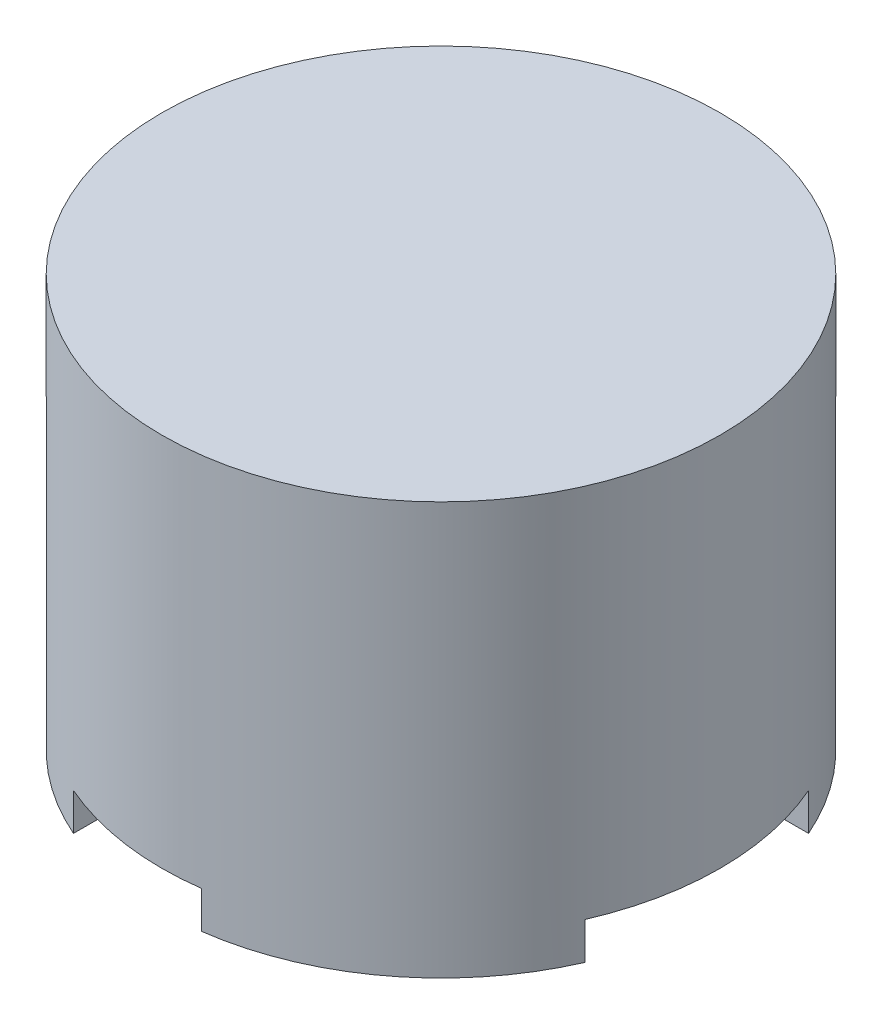
ISO-10303-21;
HEADER;
FILE_DESCRIPTION(('STEP AP214'),'2;1');
FILE_NAME('part.step','',(''),(''),'','','');
FILE_SCHEMA(('AUTOMOTIVE_DESIGN { 1 0 10303 214 1 1 1 1 }'));
ENDSEC;
DATA;
#1=APPLICATION_CONTEXT('core data for automotive mechanical design processes');
#2=APPLICATION_PROTOCOL_DEFINITION('international standard','automotive_design',2000,#1);
#3=PRODUCT_CONTEXT('',#1,'mechanical');
#4=PRODUCT('Part','Part','',(#3));
#5=PRODUCT_RELATED_PRODUCT_CATEGORY('part','',(#4));
#6=PRODUCT_DEFINITION_FORMATION('','',#4);
#7=PRODUCT_DEFINITION_CONTEXT('part definition',#1,'design');
#8=PRODUCT_DEFINITION('design','',#6,#7);
#9=PRODUCT_DEFINITION_SHAPE('','',#8);
#10=(LENGTH_UNIT() NAMED_UNIT(*) SI_UNIT(.MILLI.,.METRE.));
#11=(NAMED_UNIT(*) PLANE_ANGLE_UNIT() SI_UNIT($,.RADIAN.));
#12=(NAMED_UNIT(*) SI_UNIT($,.STERADIAN.) SOLID_ANGLE_UNIT());
#13=UNCERTAINTY_MEASURE_WITH_UNIT(LENGTH_MEASURE(1.E-05),#10,'distance_accuracy_value','');
#14=(GEOMETRIC_REPRESENTATION_CONTEXT(3) GLOBAL_UNCERTAINTY_ASSIGNED_CONTEXT((#13)) GLOBAL_UNIT_ASSIGNED_CONTEXT((#10,
#11,#12)) REPRESENTATION_CONTEXT('',''));
#15=CARTESIAN_POINT('',(0.,0.,0.));
#16=DIRECTION('',(0.,0.,1.));
#17=DIRECTION('',(1.,0.,0.));
#18=AXIS2_PLACEMENT_3D('',#15,#16,#17);
#19=CARTESIAN_POINT('',(-9.525,-19.7231,28.3950139545334));
#20=DIRECTION('',(1.,0.,0.));
#21=DIRECTION('',(0.,1.,0.));
#22=AXIS2_PLACEMENT_3D('',#19,#20,#21);
#23=PLANE('',#22);
#24=DIRECTION('',(0.,0.,1.));
#25=VECTOR('',#24,1.);
#26=CARTESIAN_POINT('',(-9.525,-22.8981,28.3950139545334));
#27=LINE('',#26,#25);
#28=CARTESIAN_POINT('',(-9.525,-22.8981,18.3079431190399));
#29=VERTEX_POINT('',#28);
#30=CARTESIAN_POINT('',(-9.525,-22.8981,21.8245167472272));
#31=VERTEX_POINT('',#30);
#32=EDGE_CURVE('E226',#29,#31,#27,.T.);
#33=ORIENTED_EDGE('',*,*,#32,.F.);
#34=DIRECTION('',(0.,1.,0.));
#35=VECTOR('',#34,1.);
#36=CARTESIAN_POINT('',(-9.525,0.,18.3079431190399));
#37=LINE('',#36,#35);
#38=CARTESIAN_POINT('',(-9.525,-19.7231,18.3079431190399));
#39=VERTEX_POINT('',#38);
#40=EDGE_CURVE('E53',#29,#39,#37,.T.);
#41=ORIENTED_EDGE('',*,*,#40,.T.);
#42=DIRECTION('',(0.,0.,1.));
#43=VECTOR('',#42,1.);
#44=CARTESIAN_POINT('',(-9.525,-19.7231,28.3950139545334));
#45=LINE('',#44,#43);
#46=CARTESIAN_POINT('',(-9.525,-19.7231,21.8245167472272));
#47=VERTEX_POINT('',#46);
#48=EDGE_CURVE('E215',#39,#47,#45,.T.);
#49=ORIENTED_EDGE('',*,*,#48,.T.);
#50=DIRECTION('',(0.,1.,0.));
#51=VECTOR('',#50,1.);
#52=CARTESIAN_POINT('',(-9.52500000000001,12.2809,21.8245167472272));
#53=LINE('',#52,#51);
#54=EDGE_CURVE('E258',#31,#47,#53,.T.);
#55=ORIENTED_EDGE('',*,*,#54,.F.);
#56=EDGE_LOOP('',(#33,#41,#49,#55));
#57=FACE_BOUND('',#56,.T.);
#58=ADVANCED_FACE('F38',(#57),#23,.T.);
#59=CARTESIAN_POINT('',(-28.3950139545334,-19.7231,9.525));
#60=DIRECTION('',(0.,0.,-1.));
#61=DIRECTION('',(-1.,0.,0.));
#62=AXIS2_PLACEMENT_3D('',#59,#60,#61);
#63=PLANE('',#62);
#64=DIRECTION('',(1.,0.,0.));
#65=VECTOR('',#64,1.);
#66=CARTESIAN_POINT('',(-28.3950139545334,-19.7231,9.525));
#67=LINE('',#66,#65);
#68=CARTESIAN_POINT('',(-21.8245167472272,-19.7231,9.525));
#69=VERTEX_POINT('',#68);
#70=CARTESIAN_POINT('',(-18.3079431190399,-19.7231,9.525));
#71=VERTEX_POINT('',#70);
#72=EDGE_CURVE('E234',#69,#71,#67,.T.);
#73=ORIENTED_EDGE('',*,*,#72,.T.);
#74=DIRECTION('',(0.,1.,0.));
#75=VECTOR('',#74,1.);
#76=CARTESIAN_POINT('',(-18.3079431190399,0.,9.525));
#77=LINE('',#76,#75);
#78=CARTESIAN_POINT('',(-18.3079431190399,-22.8981,9.525));
#79=VERTEX_POINT('',#78);
#80=EDGE_CURVE('E206',#71,#79,#77,.F.);
#81=ORIENTED_EDGE('',*,*,#80,.T.);
#82=DIRECTION('',(1.,0.,0.));
#83=VECTOR('',#82,1.);
#84=CARTESIAN_POINT('',(-23.8125,-22.8981,9.525));
#85=LINE('',#84,#83);
#86=CARTESIAN_POINT('',(-21.8245167472272,-22.8981,9.525));
#87=VERTEX_POINT('',#86);
#88=EDGE_CURVE('E357',#87,#79,#85,.T.);
#89=ORIENTED_EDGE('',*,*,#88,.F.);
#90=DIRECTION('',(0.,1.,0.));
#91=VECTOR('',#90,1.);
#92=CARTESIAN_POINT('',(-21.8245167472272,12.2809,9.525));
#93=LINE('',#92,#91);
#94=EDGE_CURVE('E255',#69,#87,#93,.F.);
#95=ORIENTED_EDGE('',*,*,#94,.F.);
#96=EDGE_LOOP('',(#73,#81,#89,#95));
#97=FACE_BOUND('',#96,.T.);
#98=ADVANCED_FACE('F417',(#97),#63,.T.);
#99=CARTESIAN_POINT('',(3.175,-19.7231,28.3950139545334));
#100=DIRECTION('',(-1.,0.,0.));
#101=DIRECTION('',(0.,0.,1.));
#102=AXIS2_PLACEMENT_3D('',#99,#100,#101);
#103=PLANE('',#102);
#104=DIRECTION('',(0.,0.,-1.));
#105=VECTOR('',#104,1.);
#106=CARTESIAN_POINT('',(3.175,-19.7231,28.3950139545334));
#107=LINE('',#106,#105);
#108=CARTESIAN_POINT('',(3.175,-19.7231,23.5998841363681));
#109=VERTEX_POINT('',#108);
#110=CARTESIAN_POINT('',(3.17499999999999,-19.7231,20.3918067186309));
#111=VERTEX_POINT('',#110);
#112=EDGE_CURVE('E212',#109,#111,#107,.T.);
#113=ORIENTED_EDGE('',*,*,#112,.T.);
#114=DIRECTION('',(0.,1.,0.));
#115=VECTOR('',#114,1.);
#116=CARTESIAN_POINT('',(3.17499999999999,0.,20.3918067186309));
#117=LINE('',#116,#115);
#118=CARTESIAN_POINT('',(3.175,-22.8981,20.3918067186309));
#119=VERTEX_POINT('',#118);
#120=EDGE_CURVE('E196',#111,#119,#117,.F.);
#121=ORIENTED_EDGE('',*,*,#120,.T.);
#122=DIRECTION('',(0.,0.,-1.));
#123=VECTOR('',#122,1.);
#124=CARTESIAN_POINT('',(3.175,-22.8981,0.));
#125=LINE('',#124,#123);
#126=CARTESIAN_POINT('',(3.175,-22.8981,23.5998841363681));
#127=VERTEX_POINT('',#126);
#128=EDGE_CURVE('E355',#127,#119,#125,.T.);
#129=ORIENTED_EDGE('',*,*,#128,.F.);
#130=DIRECTION('',(0.,1.,0.));
#131=VECTOR('',#130,1.);
#132=CARTESIAN_POINT('',(3.17499999999999,12.2809,23.5998841363681));
#133=LINE('',#132,#131);
#134=EDGE_CURVE('E221',#109,#127,#133,.F.);
#135=ORIENTED_EDGE('',*,*,#134,.F.);
#136=EDGE_LOOP('',(#113,#121,#129,#135));
#137=FACE_BOUND('',#136,.T.);
#138=ADVANCED_FACE('F219',(#137),#103,.T.);
#139=CARTESIAN_POINT('',(3.175,-19.7231,9.525));
#140=DIRECTION('',(0.,0.,-1.));
#141=DIRECTION('',(-1.,0.,0.));
#142=AXIS2_PLACEMENT_3D('',#139,#140,#141);
#143=PLANE('',#142);
#144=DIRECTION('',(1.,0.,0.));
#145=VECTOR('',#144,1.);
#146=CARTESIAN_POINT('',(3.175,-22.8981,9.525));
#147=LINE('',#146,#145);
#148=CARTESIAN_POINT('',(18.3079431190399,-22.8981,9.525));
#149=VERTEX_POINT('',#148);
#150=CARTESIAN_POINT('',(21.8245167472272,-22.8981,9.525));
#151=VERTEX_POINT('',#150);
#152=EDGE_CURVE('E223',#149,#151,#147,.T.);
#153=ORIENTED_EDGE('',*,*,#152,.F.);
#154=DIRECTION('',(0.,1.,0.));
#155=VECTOR('',#154,1.);
#156=CARTESIAN_POINT('',(18.3079431190399,0.,9.525));
#157=LINE('',#156,#155);
#158=CARTESIAN_POINT('',(18.3079431190399,-19.7231,9.525));
#159=VERTEX_POINT('',#158);
#160=EDGE_CURVE('E60',#149,#159,#157,.T.);
#161=ORIENTED_EDGE('',*,*,#160,.T.);
#162=DIRECTION('',(1.,0.,0.));
#163=VECTOR('',#162,1.);
#164=CARTESIAN_POINT('',(3.175,-19.7231,9.525));
#165=LINE('',#164,#163);
#166=CARTESIAN_POINT('',(21.8245167472272,-19.7231,9.525));
#167=VERTEX_POINT('',#166);
#168=EDGE_CURVE('E222',#159,#167,#165,.T.);
#169=ORIENTED_EDGE('',*,*,#168,.T.);
#170=DIRECTION('',(0.,1.,0.));
#171=VECTOR('',#170,1.);
#172=CARTESIAN_POINT('',(21.8245167472272,12.2809,9.525));
#173=LINE('',#172,#171);
#174=EDGE_CURVE('E251',#151,#167,#173,.T.);
#175=ORIENTED_EDGE('',*,*,#174,.F.);
#176=EDGE_LOOP('',(#153,#161,#169,#175));
#177=FACE_BOUND('',#176,.T.);
#178=ADVANCED_FACE('F563',(#177),#143,.T.);
#179=CARTESIAN_POINT('',(-28.3950139545334,-19.7231,-3.175));
#180=DIRECTION('',(0.,0.,1.));
#181=DIRECTION('',(1.,0.,0.));
#182=AXIS2_PLACEMENT_3D('',#179,#180,#181);
#183=PLANE('',#182);
#184=DIRECTION('',(-1.,0.,0.));
#185=VECTOR('',#184,1.);
#186=CARTESIAN_POINT('',(-28.3950139545334,-22.8981,-3.175));
#187=LINE('',#186,#185);
#188=CARTESIAN_POINT('',(-20.3918067186309,-22.8981,-3.175));
#189=VERTEX_POINT('',#188);
#190=CARTESIAN_POINT('',(-23.5998841363681,-22.8981,-3.175));
#191=VERTEX_POINT('',#190);
#192=EDGE_CURVE('E231',#189,#191,#187,.T.);
#193=ORIENTED_EDGE('',*,*,#192,.F.);
#194=DIRECTION('',(0.,1.,0.));
#195=VECTOR('',#194,1.);
#196=CARTESIAN_POINT('',(-20.3918067186309,0.,-3.175));
#197=LINE('',#196,#195);
#198=CARTESIAN_POINT('',(-20.3918067186309,-19.7231,-3.175));
#199=VERTEX_POINT('',#198);
#200=EDGE_CURVE('E380',#189,#199,#197,.T.);
#201=ORIENTED_EDGE('',*,*,#200,.T.);
#202=DIRECTION('',(-1.,0.,0.));
#203=VECTOR('',#202,1.);
#204=CARTESIAN_POINT('',(-28.3950139545334,-19.7231,-3.175));
#205=LINE('',#204,#203);
#206=CARTESIAN_POINT('',(-23.5998841363681,-19.7231,-3.175));
#207=VERTEX_POINT('',#206);
#208=EDGE_CURVE('E228',#199,#207,#205,.T.);
#209=ORIENTED_EDGE('',*,*,#208,.T.);
#210=DIRECTION('',(0.,1.,0.));
#211=VECTOR('',#210,1.);
#212=CARTESIAN_POINT('',(-23.5998841363681,12.2809,-3.175));
#213=LINE('',#212,#211);
#214=EDGE_CURVE('E248',#191,#207,#213,.T.);
#215=ORIENTED_EDGE('',*,*,#214,.F.);
#216=EDGE_LOOP('',(#193,#201,#209,#215));
#217=FACE_BOUND('',#216,.T.);
#218=ADVANCED_FACE('F379',(#217),#183,.T.);
#219=CARTESIAN_POINT('',(-9.525,-19.7231,-3.175));
#220=DIRECTION('',(1.,0.,0.));
#221=DIRECTION('',(0.,0.,-1.));
#222=AXIS2_PLACEMENT_3D('',#219,#220,#221);
#223=PLANE('',#222);
#224=DIRECTION('',(0.,0.,1.));
#225=VECTOR('',#224,1.);
#226=CARTESIAN_POINT('',(-9.525,-19.7231,-3.175));
#227=LINE('',#226,#225);
#228=CARTESIAN_POINT('',(-9.525,-19.7231,-21.8245167472272));
#229=VERTEX_POINT('',#228);
#230=CARTESIAN_POINT('',(-9.525,-19.7231,-18.3079431190399));
#231=VERTEX_POINT('',#230);
#232=EDGE_CURVE('E381',#229,#231,#227,.T.);
#233=ORIENTED_EDGE('',*,*,#232,.T.);
#234=DIRECTION('',(0.,1.,0.));
#235=VECTOR('',#234,1.);
#236=CARTESIAN_POINT('',(-9.525,0.,-18.3079431190399));
#237=LINE('',#236,#235);
#238=CARTESIAN_POINT('',(-9.525,-22.8981,-18.3079431190399));
#239=VERTEX_POINT('',#238);
#240=EDGE_CURVE('E398',#231,#239,#237,.F.);
#241=ORIENTED_EDGE('',*,*,#240,.T.);
#242=DIRECTION('',(0.,0.,1.));
#243=VECTOR('',#242,1.);
#244=CARTESIAN_POINT('',(-9.525,-22.8981,0.));
#245=LINE('',#244,#243);
#246=CARTESIAN_POINT('',(-9.525,-22.8981,-21.8245167472272));
#247=VERTEX_POINT('',#246);
#248=EDGE_CURVE('E352',#247,#239,#245,.T.);
#249=ORIENTED_EDGE('',*,*,#248,.F.);
#250=DIRECTION('',(0.,1.,0.));
#251=VECTOR('',#250,1.);
#252=CARTESIAN_POINT('',(-9.525,12.2809,-21.8245167472272));
#253=LINE('',#252,#251);
#254=EDGE_CURVE('E245',#229,#247,#253,.F.);
#255=ORIENTED_EDGE('',*,*,#254,.F.);
#256=EDGE_LOOP('',(#233,#241,#249,#255));
#257=FACE_BOUND('',#256,.T.);
#258=ADVANCED_FACE('F579',(#257),#223,.T.);
#259=CARTESIAN_POINT('',(9.525,-19.7231,-9.525));
#260=DIRECTION('',(-1.,0.,0.));
#261=DIRECTION('',(0.,-1.,0.));
#262=AXIS2_PLACEMENT_3D('',#259,#260,#261);
#263=PLANE('',#262);
#264=DIRECTION('',(0.,0.,-1.));
#265=VECTOR('',#264,1.);
#266=CARTESIAN_POINT('',(9.525,-22.8981,-9.525));
#267=LINE('',#266,#265);
#268=CARTESIAN_POINT('',(9.525,-22.8981,-18.3079431190399));
#269=VERTEX_POINT('',#268);
#270=CARTESIAN_POINT('',(9.525,-22.8981,-21.8245167472272));
#271=VERTEX_POINT('',#270);
#272=EDGE_CURVE('E385',#269,#271,#267,.T.);
#273=ORIENTED_EDGE('',*,*,#272,.F.);
#274=DIRECTION('',(0.,1.,0.));
#275=VECTOR('',#274,1.);
#276=CARTESIAN_POINT('',(9.525,0.,-18.3079431190399));
#277=LINE('',#276,#275);
#278=CARTESIAN_POINT('',(9.525,-19.7231,-18.3079431190399));
#279=VERTEX_POINT('',#278);
#280=EDGE_CURVE('E401',#269,#279,#277,.T.);
#281=ORIENTED_EDGE('',*,*,#280,.T.);
#282=DIRECTION('',(0.,0.,-1.));
#283=VECTOR('',#282,1.);
#284=CARTESIAN_POINT('',(9.525,-19.7231,-9.525));
#285=LINE('',#284,#283);
#286=CARTESIAN_POINT('',(9.525,-19.7231,-21.8245167472272));
#287=VERTEX_POINT('',#286);
#288=EDGE_CURVE('E387',#279,#287,#285,.T.);
#289=ORIENTED_EDGE('',*,*,#288,.T.);
#290=DIRECTION('',(0.,1.,0.));
#291=VECTOR('',#290,1.);
#292=CARTESIAN_POINT('',(9.525,12.2809,-21.8245167472272));
#293=LINE('',#292,#291);
#294=EDGE_CURVE('E242',#271,#287,#293,.T.);
#295=ORIENTED_EDGE('',*,*,#294,.F.);
#296=EDGE_LOOP('',(#273,#281,#289,#295));
#297=FACE_BOUND('',#296,.T.);
#298=ADVANCED_FACE('F588',(#297),#263,.T.);
#299=CARTESIAN_POINT('',(9.525,-19.7231,-9.525));
#300=DIRECTION('',(0.,0.,1.));
#301=DIRECTION('',(1.,0.,0.));
#302=AXIS2_PLACEMENT_3D('',#299,#300,#301);
#303=PLANE('',#302);
#304=DIRECTION('',(-1.,0.,0.));
#305=VECTOR('',#304,1.);
#306=CARTESIAN_POINT('',(9.525,-19.7231,-9.525));
#307=LINE('',#306,#305);
#308=CARTESIAN_POINT('',(21.8245167472272,-19.7231,-9.525));
#309=VERTEX_POINT('',#308);
#310=CARTESIAN_POINT('',(18.3079431190399,-19.7231,-9.525));
#311=VERTEX_POINT('',#310);
#312=EDGE_CURVE('E388',#309,#311,#307,.T.);
#313=ORIENTED_EDGE('',*,*,#312,.T.);
#314=DIRECTION('',(0.,1.,0.));
#315=VECTOR('',#314,1.);
#316=CARTESIAN_POINT('',(18.3079431190399,0.,-9.525));
#317=LINE('',#316,#315);
#318=CARTESIAN_POINT('',(18.3079431190399,-22.8981,-9.525));
#319=VERTEX_POINT('',#318);
#320=EDGE_CURVE('E403',#311,#319,#317,.F.);
#321=ORIENTED_EDGE('',*,*,#320,.T.);
#322=DIRECTION('',(-1.,0.,0.));
#323=VECTOR('',#322,1.);
#324=CARTESIAN_POINT('',(-23.8125,-22.8981,-9.525));
#325=LINE('',#324,#323);
#326=CARTESIAN_POINT('',(21.8245167472272,-22.8981,-9.525));
#327=VERTEX_POINT('',#326);
#328=EDGE_CURVE('E274',#327,#319,#325,.T.);
#329=ORIENTED_EDGE('',*,*,#328,.F.);
#330=DIRECTION('',(0.,1.,0.));
#331=VECTOR('',#330,1.);
#332=CARTESIAN_POINT('',(21.8245167472272,12.2809,-9.525));
#333=LINE('',#332,#331);
#334=EDGE_CURVE('E238',#309,#327,#333,.F.);
#335=ORIENTED_EDGE('',*,*,#334,.F.);
#336=EDGE_LOOP('',(#313,#321,#329,#335));
#337=FACE_BOUND('',#336,.T.);
#338=ADVANCED_FACE('F447',(#337),#303,.T.);
#339=CARTESIAN_POINT('',(0.,0.,0.));
#340=DIRECTION('',(0.173648177666931,0.,-0.984807753012208));
#341=DIRECTION('',(-0.984807753012208,0.,-0.173648177666931));
#342=AXIS2_PLACEMENT_3D('',#339,#340,#341);
#343=PLANE('',#342);
#344=DIRECTION('',(0.,-1.,0.));
#345=VECTOR('',#344,1.);
#346=CARTESIAN_POINT('',(20.3239700704098,3.7592,3.58366427852457));
#347=LINE('',#346,#345);
#348=CARTESIAN_POINT('',(20.3239700704098,3.7592,3.58366427852457));
#349=VERTEX_POINT('',#348);
#350=CARTESIAN_POINT('',(20.3239700704098,-3.7592,3.58366427852457));
#351=VERTEX_POINT('',#350);
#352=EDGE_CURVE('E271',#349,#351,#347,.T.);
#353=ORIENTED_EDGE('',*,*,#352,.T.);
#354=DIRECTION('',(-0.984807753012208,0.,-0.173648177666931));
#355=VECTOR('',#354,1.);
#356=CARTESIAN_POINT('',(20.3239700704098,-3.7592,3.58366427852457));
#357=LINE('',#356,#355);
#358=CARTESIAN_POINT('',(17.5098818485571,-3.7592,3.08746459891803));
#359=VERTEX_POINT('',#358);
#360=EDGE_CURVE('E275',#351,#359,#357,.T.);
#361=ORIENTED_EDGE('',*,*,#360,.T.);
#362=DIRECTION('',(0.,1.,0.));
#363=VECTOR('',#362,1.);
#364=CARTESIAN_POINT('',(17.5098818485571,3.7592,3.08746459891803));
#365=LINE('',#364,#363);
#366=CARTESIAN_POINT('',(17.5098818485571,3.7592,3.08746459891803));
#367=VERTEX_POINT('',#366);
#368=EDGE_CURVE('E277',#359,#367,#365,.T.);
#369=ORIENTED_EDGE('',*,*,#368,.T.);
#370=DIRECTION('',(0.984807753012208,0.,0.173648177666931));
#371=VECTOR('',#370,1.);
#372=CARTESIAN_POINT('',(20.3239700704098,3.7592,3.58366427852457));
#373=LINE('',#372,#371);
#374=EDGE_CURVE('E280',#367,#349,#373,.T.);
#375=ORIENTED_EDGE('',*,*,#374,.T.);
#376=EDGE_LOOP('',(#353,#361,#369,#375));
#377=FACE_BOUND('',#376,.T.);
#378=ADVANCED_FACE('F443',(#377),#343,.T.);
#379=CARTESIAN_POINT('',(0.,0.,0.));
#380=DIRECTION('',(-0.173648177666931,0.,-0.984807753012208));
#381=DIRECTION('',(-0.984807753012208,0.,0.173648177666931));
#382=AXIS2_PLACEMENT_3D('',#379,#380,#381);
#383=PLANE('',#382);
#384=DIRECTION('',(0.,-1.,0.));
#385=VECTOR('',#384,1.);
#386=CARTESIAN_POINT('',(20.3239700704098,3.7592,-3.58366427852457));
#387=LINE('',#386,#385);
#388=CARTESIAN_POINT('',(20.3239700704098,3.7592,-3.58366427852457));
#389=VERTEX_POINT('',#388);
#390=CARTESIAN_POINT('',(20.3239700704098,-3.7592,-3.58366427852457));
#391=VERTEX_POINT('',#390);
#392=EDGE_CURVE('E282',#389,#391,#387,.T.);
#393=ORIENTED_EDGE('',*,*,#392,.F.);
#394=DIRECTION('',(0.984807753012208,0.,-0.173648177666931));
#395=VECTOR('',#394,1.);
#396=CARTESIAN_POINT('',(20.3239700704098,3.7592,-3.58366427852457));
#397=LINE('',#396,#395);
#398=CARTESIAN_POINT('',(17.5098818485571,3.75919999999999,-3.08746459891803));
#399=VERTEX_POINT('',#398);
#400=EDGE_CURVE('E290',#399,#389,#397,.T.);
#401=ORIENTED_EDGE('',*,*,#400,.F.);
#402=DIRECTION('',(0.,1.,0.));
#403=VECTOR('',#402,1.);
#404=CARTESIAN_POINT('',(17.5098818485571,3.7592,-3.08746459891803));
#405=LINE('',#404,#403);
#406=CARTESIAN_POINT('',(17.5098818485571,-3.7592,-3.08746459891803));
#407=VERTEX_POINT('',#406);
#408=EDGE_CURVE('E287',#407,#399,#405,.T.);
#409=ORIENTED_EDGE('',*,*,#408,.F.);
#410=DIRECTION('',(-0.984807753012208,0.,0.173648177666931));
#411=VECTOR('',#410,1.);
#412=CARTESIAN_POINT('',(20.3239700704098,-3.7592,-3.58366427852457));
#413=LINE('',#412,#411);
#414=EDGE_CURVE('E285',#391,#407,#413,.T.);
#415=ORIENTED_EDGE('',*,*,#414,.F.);
#416=EDGE_LOOP('',(#393,#401,#409,#415));
#417=FACE_BOUND('',#416,.T.);
#418=ADVANCED_FACE('F446',(#417),#383,.F.);
#419=CARTESIAN_POINT('',(20.3239700704098,3.7592,-3.58366427852457));
#420=DIRECTION('',(0.,-1.,0.));
#421=DIRECTION('',(0.,0.,1.));
#422=AXIS2_PLACEMENT_3D('',#419,#420,#421);
#423=PLANE('',#422);
#424=ORIENTED_EDGE('',*,*,#400,.T.);
#425=CARTESIAN_POINT('',(0.,3.7592,0.));
#426=DIRECTION('',(0.,-1.,0.));
#427=DIRECTION('',(0.,0.,1.));
#428=AXIS2_PLACEMENT_3D('',#425,#426,#427);
#429=CIRCLE('',#428,20.6375000686635);
#430=EDGE_CURVE('E292',#389,#349,#429,.T.);
#431=ORIENTED_EDGE('',*,*,#430,.T.);
#432=ORIENTED_EDGE('',*,*,#374,.F.);
#433=CARTESIAN_POINT('',(0.,3.7592,0.));
#434=DIRECTION('',(0.,-1.,0.));
#435=DIRECTION('',(0.,0.,1.));
#436=AXIS2_PLACEMENT_3D('',#433,#434,#435);
#437=CIRCLE('',#436,17.78);
#438=EDGE_CURVE('E295',#399,#367,#437,.T.);
#439=ORIENTED_EDGE('',*,*,#438,.F.);
#440=EDGE_LOOP('',(#424,#431,#432,#439));
#441=FACE_BOUND('',#440,.T.);
#442=ADVANCED_FACE('F451',(#441),#423,.T.);
#443=CARTESIAN_POINT('',(20.3239700704098,-3.7592,-3.58366427852457));
#444=DIRECTION('',(0.,1.,0.));
#445=DIRECTION('',(0.,0.,-1.));
#446=AXIS2_PLACEMENT_3D('',#443,#444,#445);
#447=PLANE('',#446);
#448=CARTESIAN_POINT('',(0.,-3.7592,0.));
#449=DIRECTION('',(0.,-1.,0.));
#450=DIRECTION('',(0.,0.,1.));
#451=AXIS2_PLACEMENT_3D('',#448,#449,#450);
#452=CIRCLE('',#451,17.78);
#453=EDGE_CURVE('E298',#407,#359,#452,.T.);
#454=ORIENTED_EDGE('',*,*,#453,.T.);
#455=ORIENTED_EDGE('',*,*,#360,.F.);
#456=CARTESIAN_POINT('',(0.,-3.7592,0.));
#457=DIRECTION('',(0.,-1.,0.));
#458=DIRECTION('',(0.,0.,1.));
#459=AXIS2_PLACEMENT_3D('',#456,#457,#458);
#460=CIRCLE('',#459,20.6375000686635);
#461=EDGE_CURVE('E301',#391,#351,#460,.T.);
#462=ORIENTED_EDGE('',*,*,#461,.F.);
#463=ORIENTED_EDGE('',*,*,#414,.T.);
#464=EDGE_LOOP('',(#454,#455,#462,#463));
#465=FACE_BOUND('',#464,.T.);
#466=ADVANCED_FACE('F457',(#465),#447,.T.);
#467=CARTESIAN_POINT('',(0.,0.,0.));
#468=DIRECTION('',(0.,-1.,0.));
#469=DIRECTION('',(0.,0.,1.));
#470=AXIS2_PLACEMENT_3D('',#467,#468,#469);
#471=CYLINDRICAL_SURFACE('',#470,20.6375000686635);
#472=ORIENTED_EDGE('',*,*,#461,.T.);
#473=ORIENTED_EDGE('',*,*,#352,.F.);
#474=ORIENTED_EDGE('',*,*,#430,.F.);
#475=ORIENTED_EDGE('',*,*,#392,.T.);
#476=EDGE_LOOP('',(#472,#473,#474,#475));
#477=FACE_BOUND('',#476,.T.);
#478=ADVANCED_FACE('F453',(#477),#471,.F.);
#479=CARTESIAN_POINT('',(0.,0.,0.));
#480=DIRECTION('',(-0.173648177666931,0.,0.984807753012208));
#481=DIRECTION('',(0.984807753012208,0.,0.173648177666931));
#482=AXIS2_PLACEMENT_3D('',#479,#480,#481);
#483=PLANE('',#482);
#484=DIRECTION('',(0.,-1.,0.));
#485=VECTOR('',#484,1.);
#486=CARTESIAN_POINT('',(-20.3239700704098,3.7592,-3.58366427852457));
#487=LINE('',#486,#485);
#488=CARTESIAN_POINT('',(-20.3239700704098,3.7592,-3.58366427852457));
#489=VERTEX_POINT('',#488);
#490=CARTESIAN_POINT('',(-20.3239700704098,-3.7592,-3.58366427852457));
#491=VERTEX_POINT('',#490);
#492=EDGE_CURVE('E304',#489,#491,#487,.T.);
#493=ORIENTED_EDGE('',*,*,#492,.T.);
#494=DIRECTION('',(0.984807753012208,0.,0.173648177666931));
#495=VECTOR('',#494,1.);
#496=CARTESIAN_POINT('',(-20.3239700704098,-3.7592,-3.58366427852457));
#497=LINE('',#496,#495);
#498=CARTESIAN_POINT('',(-17.5098818485571,-3.7592,-3.08746459891803));
#499=VERTEX_POINT('',#498);
#500=EDGE_CURVE('E307',#491,#499,#497,.T.);
#501=ORIENTED_EDGE('',*,*,#500,.T.);
#502=DIRECTION('',(0.,1.,0.));
#503=VECTOR('',#502,1.);
#504=CARTESIAN_POINT('',(-17.5098818485571,3.7592,-3.08746459891803));
#505=LINE('',#504,#503);
#506=CARTESIAN_POINT('',(-17.5098818485571,3.7592,-3.08746459891803));
#507=VERTEX_POINT('',#506);
#508=EDGE_CURVE('E309',#499,#507,#505,.T.);
#509=ORIENTED_EDGE('',*,*,#508,.T.);
#510=DIRECTION('',(-0.984807753012208,0.,-0.173648177666931));
#511=VECTOR('',#510,1.);
#512=CARTESIAN_POINT('',(-20.3239700704098,3.7592,-3.58366427852457));
#513=LINE('',#512,#511);
#514=EDGE_CURVE('E312',#507,#489,#513,.T.);
#515=ORIENTED_EDGE('',*,*,#514,.T.);
#516=EDGE_LOOP('',(#493,#501,#509,#515));
#517=FACE_BOUND('',#516,.T.);
#518=ADVANCED_FACE('F456',(#517),#483,.T.);
#519=CARTESIAN_POINT('',(0.,0.,0.));
#520=DIRECTION('',(0.173648177666931,0.,0.984807753012208));
#521=DIRECTION('',(0.984807753012208,0.,-0.173648177666931));
#522=AXIS2_PLACEMENT_3D('',#519,#520,#521);
#523=PLANE('',#522);
#524=DIRECTION('',(0.,-1.,0.));
#525=VECTOR('',#524,1.);
#526=CARTESIAN_POINT('',(-20.3239700704098,3.7592,3.58366427852457));
#527=LINE('',#526,#525);
#528=CARTESIAN_POINT('',(-20.3239700704098,3.7592,3.58366427852457));
#529=VERTEX_POINT('',#528);
#530=CARTESIAN_POINT('',(-20.3239700704098,-3.7592,3.58366427852457));
#531=VERTEX_POINT('',#530);
#532=EDGE_CURVE('E314',#529,#531,#527,.T.);
#533=ORIENTED_EDGE('',*,*,#532,.F.);
#534=DIRECTION('',(-0.984807753012208,0.,0.173648177666931));
#535=VECTOR('',#534,1.);
#536=CARTESIAN_POINT('',(-20.3239700704098,3.7592,3.58366427852457));
#537=LINE('',#536,#535);
#538=CARTESIAN_POINT('',(-17.5098818485571,3.75919999999999,3.08746459891803));
#539=VERTEX_POINT('',#538);
#540=EDGE_CURVE('E322',#539,#529,#537,.T.);
#541=ORIENTED_EDGE('',*,*,#540,.F.);
#542=DIRECTION('',(0.,1.,0.));
#543=VECTOR('',#542,1.);
#544=CARTESIAN_POINT('',(-17.5098818485571,3.7592,3.08746459891803));
#545=LINE('',#544,#543);
#546=CARTESIAN_POINT('',(-17.5098818485571,-3.7592,3.08746459891803));
#547=VERTEX_POINT('',#546);
#548=EDGE_CURVE('E319',#547,#539,#545,.T.);
#549=ORIENTED_EDGE('',*,*,#548,.F.);
#550=DIRECTION('',(0.984807753012208,0.,-0.173648177666931));
#551=VECTOR('',#550,1.);
#552=CARTESIAN_POINT('',(-20.3239700704098,-3.7592,3.58366427852457));
#553=LINE('',#552,#551);
#554=EDGE_CURVE('E317',#531,#547,#553,.T.);
#555=ORIENTED_EDGE('',*,*,#554,.F.);
#556=EDGE_LOOP('',(#533,#541,#549,#555));
#557=FACE_BOUND('',#556,.T.);
#558=ADVANCED_FACE('F467',(#557),#523,.F.);
#559=CARTESIAN_POINT('',(-20.3239700704098,3.7592,3.58366427852457));
#560=DIRECTION('',(0.,-1.,0.));
#561=DIRECTION('',(0.,0.,-1.));
#562=AXIS2_PLACEMENT_3D('',#559,#560,#561);
#563=PLANE('',#562);
#564=ORIENTED_EDGE('',*,*,#540,.T.);
#565=CARTESIAN_POINT('',(0.,3.7592,0.));
#566=DIRECTION('',(0.,-1.,0.));
#567=DIRECTION('',(0.,0.,-1.));
#568=AXIS2_PLACEMENT_3D('',#565,#566,#567);
#569=CIRCLE('',#568,20.6375000686635);
#570=EDGE_CURVE('E324',#529,#489,#569,.T.);
#571=ORIENTED_EDGE('',*,*,#570,.T.);
#572=ORIENTED_EDGE('',*,*,#514,.F.);
#573=CARTESIAN_POINT('',(0.,3.7592,0.));
#574=DIRECTION('',(0.,-1.,0.));
#575=DIRECTION('',(0.,0.,-1.));
#576=AXIS2_PLACEMENT_3D('',#573,#574,#575);
#577=CIRCLE('',#576,17.78);
#578=EDGE_CURVE('E327',#539,#507,#577,.T.);
#579=ORIENTED_EDGE('',*,*,#578,.F.);
#580=EDGE_LOOP('',(#564,#571,#572,#579));
#581=FACE_BOUND('',#580,.T.);
#582=ADVANCED_FACE('F471',(#581),#563,.T.);
#583=CARTESIAN_POINT('',(-20.3239700704098,-3.7592,3.58366427852457));
#584=DIRECTION('',(0.,1.,0.));
#585=DIRECTION('',(0.,0.,1.));
#586=AXIS2_PLACEMENT_3D('',#583,#584,#585);
#587=PLANE('',#586);
#588=CARTESIAN_POINT('',(0.,-3.7592,0.));
#589=DIRECTION('',(0.,-1.,0.));
#590=DIRECTION('',(0.,0.,-1.));
#591=AXIS2_PLACEMENT_3D('',#588,#589,#590);
#592=CIRCLE('',#591,17.78);
#593=EDGE_CURVE('E330',#547,#499,#592,.T.);
#594=ORIENTED_EDGE('',*,*,#593,.T.);
#595=ORIENTED_EDGE('',*,*,#500,.F.);
#596=CARTESIAN_POINT('',(0.,-3.7592,0.));
#597=DIRECTION('',(0.,-1.,0.));
#598=DIRECTION('',(0.,0.,-1.));
#599=AXIS2_PLACEMENT_3D('',#596,#597,#598);
#600=CIRCLE('',#599,20.6375000686635);
#601=EDGE_CURVE('E333',#531,#491,#600,.T.);
#602=ORIENTED_EDGE('',*,*,#601,.F.);
#603=ORIENTED_EDGE('',*,*,#554,.T.);
#604=EDGE_LOOP('',(#594,#595,#602,#603));
#605=FACE_BOUND('',#604,.T.);
#606=ADVANCED_FACE('F476',(#605),#587,.T.);
#607=CARTESIAN_POINT('',(0.,0.,0.));
#608=DIRECTION('',(0.,-1.,0.));
#609=DIRECTION('',(0.,0.,-1.));
#610=AXIS2_PLACEMENT_3D('',#607,#608,#609);
#611=CYLINDRICAL_SURFACE('',#610,20.6375000686635);
#612=ORIENTED_EDGE('',*,*,#601,.T.);
#613=ORIENTED_EDGE('',*,*,#492,.F.);
#614=ORIENTED_EDGE('',*,*,#570,.F.);
#615=ORIENTED_EDGE('',*,*,#532,.T.);
#616=EDGE_LOOP('',(#612,#613,#614,#615));
#617=FACE_BOUND('',#616,.T.);
#618=ADVANCED_FACE('F473',(#617),#611,.F.);
#619=CARTESIAN_POINT('',(0.,5.0419,0.));
#620=DIRECTION('',(0.,1.,0.));
#621=DIRECTION('',(0.,0.,1.));
#622=AXIS2_PLACEMENT_3D('',#619,#620,#621);
#623=TOROIDAL_SURFACE('',#622,16.5735000686635,4.064);
#624=CARTESIAN_POINT('',(0.,9.1059,0.));
#625=DIRECTION('',(0.,-1.,0.));
#626=DIRECTION('',(0.,0.,-1.));
#627=AXIS2_PLACEMENT_3D('',#624,#625,#626);
#628=CIRCLE('',#627,16.5735000686635);
#629=CARTESIAN_POINT('',(0.,9.1059,-16.5735000686635));
#630=VERTEX_POINT('',#629);
#631=EDGE_CURVE('E269',#630,#630,#628,.F.);
#632=ORIENTED_EDGE('',*,*,#631,.T.);
#633=EDGE_LOOP('',(#632));
#634=FACE_BOUND('',#633,.T.);
#635=CARTESIAN_POINT('',(0.,5.04264705882353,0.));
#636=DIRECTION('',(0.,-1.,0.));
#637=DIRECTION('',(0.,0.,-1.));
#638=AXIS2_PLACEMENT_3D('',#635,#636,#637);
#639=CIRCLE('',#638,20.6375);
#640=CARTESIAN_POINT('',(0.,5.04264705882353,-20.6375));
#641=VERTEX_POINT('',#640);
#642=EDGE_CURVE('E345',#641,#641,#639,.T.);
#643=ORIENTED_EDGE('',*,*,#642,.T.);
#644=EDGE_LOOP('',(#643));
#645=FACE_BOUND('',#644,.T.);
#646=ADVANCED_FACE('F40',(#634,#645),#623,.F.);
#647=CARTESIAN_POINT('',(0.,0.,0.));
#648=DIRECTION('',(0.,-1.,0.));
#649=DIRECTION('',(0.,0.,-1.));
#650=AXIS2_PLACEMENT_3D('',#647,#648,#649);
#651=CYLINDRICAL_SURFACE('',#650,20.6375);
#652=CARTESIAN_POINT('',(0.,-19.7231,0.));
#653=DIRECTION('',(0.,-1.,0.));
#654=DIRECTION('',(0.,0.,-1.));
#655=AXIS2_PLACEMENT_3D('',#652,#653,#654);
#656=CIRCLE('',#655,20.6375);
#657=EDGE_CURVE('E261',#231,#279,#656,.T.);
#658=ORIENTED_EDGE('',*,*,#657,.T.);
#659=ORIENTED_EDGE('',*,*,#280,.F.);
#660=CARTESIAN_POINT('',(0.,-22.8981,0.));
#661=DIRECTION('',(0.,-1.,0.));
#662=DIRECTION('',(1.,0.,0.));
#663=AXIS2_PLACEMENT_3D('',#660,#661,#662);
#664=CIRCLE('',#663,20.6375);
#665=EDGE_CURVE('E13',#319,#269,#664,.F.);
#666=ORIENTED_EDGE('',*,*,#665,.F.);
#667=ORIENTED_EDGE('',*,*,#320,.F.);
#668=EDGE_CURVE('E216',#311,#159,#656,.T.);
#669=ORIENTED_EDGE('',*,*,#668,.T.);
#670=ORIENTED_EDGE('',*,*,#160,.F.);
#671=CARTESIAN_POINT('',(0.,-22.8981,0.));
#672=DIRECTION('',(0.,1.,0.));
#673=DIRECTION('',(0.,0.,1.));
#674=AXIS2_PLACEMENT_3D('',#671,#672,#673);
#675=CIRCLE('',#674,20.6375);
#676=EDGE_CURVE('E202',#119,#149,#675,.T.);
#677=ORIENTED_EDGE('',*,*,#676,.F.);
#678=ORIENTED_EDGE('',*,*,#120,.F.);
#679=EDGE_CURVE('E201',#111,#39,#656,.T.);
#680=ORIENTED_EDGE('',*,*,#679,.T.);
#681=ORIENTED_EDGE('',*,*,#40,.F.);
#682=EDGE_CURVE('E407',#79,#29,#675,.T.);
#683=ORIENTED_EDGE('',*,*,#682,.F.);
#684=ORIENTED_EDGE('',*,*,#80,.F.);
#685=EDGE_CURVE('E217',#71,#199,#656,.T.);
#686=ORIENTED_EDGE('',*,*,#685,.T.);
#687=ORIENTED_EDGE('',*,*,#200,.F.);
#688=EDGE_CURVE('E406',#239,#189,#675,.T.);
#689=ORIENTED_EDGE('',*,*,#688,.F.);
#690=ORIENTED_EDGE('',*,*,#240,.F.);
#691=EDGE_LOOP('',(#658,#659,#666,#667,#669,#670,#677,#678,#680,#681,#683,#684,#686,#687,#689,#690));
#692=FACE_BOUND('',#691,.T.);
#693=CARTESIAN_POINT('',(0.,-5.04264705882353,0.));
#694=DIRECTION('',(0.,-1.,0.));
#695=DIRECTION('',(0.,0.,-1.));
#696=AXIS2_PLACEMENT_3D('',#693,#694,#695);
#697=CIRCLE('',#696,20.6375);
#698=CARTESIAN_POINT('',(0.,-5.04264705882353,-20.6375));
#699=VERTEX_POINT('',#698);
#700=EDGE_CURVE('E335',#699,#699,#697,.T.);
#701=ORIENTED_EDGE('',*,*,#700,.F.);
#702=EDGE_LOOP('',(#701));
#703=FACE_BOUND('',#702,.T.);
#704=ADVANCED_FACE('F199',(#692,#703),#651,.F.);
#705=CARTESIAN_POINT('',(-17.78,-5.04264705882353,0.));
#706=DIRECTION('',(0.,-1.,0.));
#707=DIRECTION('',(0.,0.,-1.));
#708=AXIS2_PLACEMENT_3D('',#705,#706,#707);
#709=PLANE('',#708);
#710=ORIENTED_EDGE('',*,*,#700,.T.);
#711=EDGE_LOOP('',(#710));
#712=FACE_BOUND('',#711,.T.);
#713=CARTESIAN_POINT('',(0.,-5.04264705882353,0.));
#714=DIRECTION('',(0.,-1.,0.));
#715=DIRECTION('',(0.,0.,-1.));
#716=AXIS2_PLACEMENT_3D('',#713,#714,#715);
#717=CIRCLE('',#716,17.78);
#718=CARTESIAN_POINT('',(0.,-5.04264705882353,-17.78));
#719=VERTEX_POINT('',#718);
#720=EDGE_CURVE('E339',#719,#719,#717,.T.);
#721=ORIENTED_EDGE('',*,*,#720,.F.);
#722=EDGE_LOOP('',(#721));
#723=FACE_BOUND('',#722,.T.);
#724=ADVANCED_FACE('F486',(#712,#723),#709,.T.);
#725=CARTESIAN_POINT('',(0.,0.,0.));
#726=DIRECTION('',(0.,-1.,0.));
#727=DIRECTION('',(0.,0.,-1.));
#728=AXIS2_PLACEMENT_3D('',#725,#726,#727);
#729=CYLINDRICAL_SURFACE('',#728,17.78);
#730=ORIENTED_EDGE('',*,*,#438,.T.);
#731=ORIENTED_EDGE('',*,*,#368,.F.);
#732=ORIENTED_EDGE('',*,*,#453,.F.);
#733=ORIENTED_EDGE('',*,*,#408,.T.);
#734=EDGE_LOOP('',(#730,#731,#732,#733));
#735=FACE_BOUND('',#734,.T.);
#736=ORIENTED_EDGE('',*,*,#578,.T.);
#737=ORIENTED_EDGE('',*,*,#508,.F.);
#738=ORIENTED_EDGE('',*,*,#593,.F.);
#739=ORIENTED_EDGE('',*,*,#548,.T.);
#740=EDGE_LOOP('',(#736,#737,#738,#739));
#741=FACE_BOUND('',#740,.T.);
#742=ORIENTED_EDGE('',*,*,#720,.T.);
#743=EDGE_LOOP('',(#742));
#744=FACE_BOUND('',#743,.T.);
#745=CARTESIAN_POINT('',(0.,5.04264705882353,0.));
#746=DIRECTION('',(0.,-1.,0.));
#747=DIRECTION('',(0.,0.,-1.));
#748=AXIS2_PLACEMENT_3D('',#745,#746,#747);
#749=CIRCLE('',#748,17.78);
#750=CARTESIAN_POINT('',(0.,5.04264705882353,-17.78));
#751=VERTEX_POINT('',#750);
#752=EDGE_CURVE('E342',#751,#751,#749,.T.);
#753=ORIENTED_EDGE('',*,*,#752,.F.);
#754=EDGE_LOOP('',(#753));
#755=FACE_BOUND('',#754,.T.);
#756=ADVANCED_FACE('F489',(#735,#741,#744,#755),#729,.F.);
#757=CARTESIAN_POINT('',(-17.78,5.04264705882353,0.));
#758=DIRECTION('',(0.,1.,0.));
#759=DIRECTION('',(0.,0.,1.));
#760=AXIS2_PLACEMENT_3D('',#757,#758,#759);
#761=PLANE('',#760);
#762=ORIENTED_EDGE('',*,*,#752,.T.);
#763=EDGE_LOOP('',(#762));
#764=FACE_BOUND('',#763,.T.);
#765=ORIENTED_EDGE('',*,*,#642,.F.);
#766=EDGE_LOOP('',(#765));
#767=FACE_BOUND('',#766,.T.);
#768=ADVANCED_FACE('F493',(#764,#767),#761,.T.);
#769=CARTESIAN_POINT('',(0.,9.1059,0.));
#770=DIRECTION('',(0.,-1.,0.));
#771=DIRECTION('',(0.,0.,-1.));
#772=AXIS2_PLACEMENT_3D('',#769,#770,#771);
#773=PLANE('',#772);
#774=ORIENTED_EDGE('',*,*,#631,.F.);
#775=EDGE_LOOP('',(#774));
#776=FACE_BOUND('',#775,.T.);
#777=ADVANCED_FACE('F496',(#776),#773,.T.);
#778=CARTESIAN_POINT('',(0.,-19.7231,0.));
#779=DIRECTION('',(0.,-1.,0.));
#780=DIRECTION('',(1.,0.,0.));
#781=AXIS2_PLACEMENT_3D('',#778,#779,#780);
#782=PLANE('',#781);
#783=ORIENTED_EDGE('',*,*,#312,.F.);
#784=CARTESIAN_POINT('',(0.,-19.7231,0.));
#785=DIRECTION('',(0.,-1.,0.));
#786=DIRECTION('',(1.,0.,0.));
#787=AXIS2_PLACEMENT_3D('',#784,#785,#786);
#788=CIRCLE('',#787,23.8125);
#789=EDGE_CURVE('E359',#167,#309,#788,.F.);
#790=ORIENTED_EDGE('',*,*,#789,.F.);
#791=ORIENTED_EDGE('',*,*,#168,.F.);
#792=ORIENTED_EDGE('',*,*,#668,.F.);
#793=EDGE_LOOP('',(#783,#790,#791,#792));
#794=FACE_BOUND('',#793,.T.);
#795=ADVANCED_FACE('F431',(#794),#782,.T.);
#796=ORIENTED_EDGE('',*,*,#112,.F.);
#797=EDGE_CURVE('E46',#47,#109,#788,.F.);
#798=ORIENTED_EDGE('',*,*,#797,.F.);
#799=ORIENTED_EDGE('',*,*,#48,.F.);
#800=ORIENTED_EDGE('',*,*,#679,.F.);
#801=EDGE_LOOP('',(#796,#798,#799,#800));
#802=FACE_BOUND('',#801,.T.);
#803=ADVANCED_FACE('F211',(#802),#782,.T.);
#804=ORIENTED_EDGE('',*,*,#72,.F.);
#805=EDGE_CURVE('E364',#207,#69,#788,.F.);
#806=ORIENTED_EDGE('',*,*,#805,.F.);
#807=ORIENTED_EDGE('',*,*,#208,.F.);
#808=ORIENTED_EDGE('',*,*,#685,.F.);
#809=EDGE_LOOP('',(#804,#806,#807,#808));
#810=FACE_BOUND('',#809,.T.);
#811=ADVANCED_FACE('F374',(#810),#782,.T.);
#812=ORIENTED_EDGE('',*,*,#232,.F.);
#813=EDGE_CURVE('E361',#287,#229,#788,.F.);
#814=ORIENTED_EDGE('',*,*,#813,.F.);
#815=ORIENTED_EDGE('',*,*,#288,.F.);
#816=ORIENTED_EDGE('',*,*,#657,.F.);
#817=EDGE_LOOP('',(#812,#814,#815,#816));
#818=FACE_BOUND('',#817,.T.);
#819=ADVANCED_FACE('F427',(#818),#782,.T.);
#820=CARTESIAN_POINT('',(0.,12.2809,0.));
#821=DIRECTION('',(0.,1.,0.));
#822=DIRECTION('',(-1.,0.,0.));
#823=AXIS2_PLACEMENT_3D('',#820,#821,#822);
#824=CYLINDRICAL_SURFACE('',#823,23.8125);
#825=CARTESIAN_POINT('',(0.,12.2809,0.));
#826=DIRECTION('',(0.,1.,0.));
#827=DIRECTION('',(-1.,0.,0.));
#828=AXIS2_PLACEMENT_3D('',#825,#826,#827);
#829=CIRCLE('',#828,23.8125);
#830=CARTESIAN_POINT('',(-23.8125,12.2809,0.));
#831=VERTEX_POINT('',#830);
#832=EDGE_CURVE('E262',#831,#831,#829,.T.);
#833=ORIENTED_EDGE('',*,*,#832,.F.);
#834=EDGE_LOOP('',(#833));
#835=FACE_BOUND('',#834,.T.);
#836=CARTESIAN_POINT('',(0.,-22.8981,0.));
#837=DIRECTION('',(0.,1.,0.));
#838=DIRECTION('',(-1.,0.,0.));
#839=AXIS2_PLACEMENT_3D('',#836,#837,#838);
#840=CIRCLE('',#839,23.8125);
#841=EDGE_CURVE('E266',#87,#31,#840,.T.);
#842=ORIENTED_EDGE('',*,*,#841,.T.);
#843=ORIENTED_EDGE('',*,*,#54,.T.);
#844=ORIENTED_EDGE('',*,*,#797,.T.);
#845=ORIENTED_EDGE('',*,*,#134,.T.);
#846=EDGE_CURVE('E270',#127,#151,#840,.T.);
#847=ORIENTED_EDGE('',*,*,#846,.T.);
#848=ORIENTED_EDGE('',*,*,#174,.T.);
#849=ORIENTED_EDGE('',*,*,#789,.T.);
#850=ORIENTED_EDGE('',*,*,#334,.T.);
#851=EDGE_CURVE('E739',#327,#271,#840,.T.);
#852=ORIENTED_EDGE('',*,*,#851,.T.);
#853=ORIENTED_EDGE('',*,*,#294,.T.);
#854=ORIENTED_EDGE('',*,*,#813,.T.);
#855=ORIENTED_EDGE('',*,*,#254,.T.);
#856=EDGE_CURVE('E265',#247,#191,#840,.T.);
#857=ORIENTED_EDGE('',*,*,#856,.T.);
#858=ORIENTED_EDGE('',*,*,#214,.T.);
#859=ORIENTED_EDGE('',*,*,#805,.T.);
#860=ORIENTED_EDGE('',*,*,#94,.T.);
#861=EDGE_LOOP('',(#842,#843,#844,#845,#847,#848,#849,#850,#852,#853,#854,#855,#857,#858,#859,#860));
#862=FACE_BOUND('',#861,.T.);
#863=ADVANCED_FACE('F366',(#835,#862),#824,.T.);
#864=CARTESIAN_POINT('',(-23.8125,-22.8981,0.));
#865=DIRECTION('',(0.,-1.,0.));
#866=DIRECTION('',(1.,0.,0.));
#867=AXIS2_PLACEMENT_3D('',#864,#865,#866);
#868=PLANE('',#867);
#869=ORIENTED_EDGE('',*,*,#88,.T.);
#870=ORIENTED_EDGE('',*,*,#682,.T.);
#871=ORIENTED_EDGE('',*,*,#32,.T.);
#872=ORIENTED_EDGE('',*,*,#841,.F.);
#873=EDGE_LOOP('',(#869,#870,#871,#872));
#874=FACE_BOUND('',#873,.T.);
#875=ADVANCED_FACE('F413',(#874),#868,.T.);
#876=ORIENTED_EDGE('',*,*,#128,.T.);
#877=ORIENTED_EDGE('',*,*,#676,.T.);
#878=ORIENTED_EDGE('',*,*,#152,.T.);
#879=ORIENTED_EDGE('',*,*,#846,.F.);
#880=EDGE_LOOP('',(#876,#877,#878,#879));
#881=FACE_BOUND('',#880,.T.);
#882=ADVANCED_FACE('F439',(#881),#868,.T.);
#883=ORIENTED_EDGE('',*,*,#248,.T.);
#884=ORIENTED_EDGE('',*,*,#688,.T.);
#885=ORIENTED_EDGE('',*,*,#192,.T.);
#886=ORIENTED_EDGE('',*,*,#856,.F.);
#887=EDGE_LOOP('',(#883,#884,#885,#886));
#888=FACE_BOUND('',#887,.T.);
#889=ADVANCED_FACE('F689',(#888),#868,.T.);
#890=ORIENTED_EDGE('',*,*,#328,.T.);
#891=ORIENTED_EDGE('',*,*,#665,.T.);
#892=ORIENTED_EDGE('',*,*,#272,.T.);
#893=ORIENTED_EDGE('',*,*,#851,.F.);
#894=EDGE_LOOP('',(#890,#891,#892,#893));
#895=FACE_BOUND('',#894,.T.);
#896=ADVANCED_FACE('F435',(#895),#868,.T.);
#897=CARTESIAN_POINT('',(-23.8125,12.2809,0.));
#898=DIRECTION('',(0.,1.,0.));
#899=DIRECTION('',(-1.,0.,0.));
#900=AXIS2_PLACEMENT_3D('',#897,#898,#899);
#901=PLANE('',#900);
#902=ORIENTED_EDGE('',*,*,#832,.T.);
#903=EDGE_LOOP('',(#902));
#904=FACE_BOUND('',#903,.T.);
#905=ADVANCED_FACE('F432',(#904),#901,.T.);
#906=CLOSED_SHELL('',(#58,#98,#138,#178,#218,#258,#298,#338,#378,#418,#442,#466,#478,#518,#558,
#582,#606,#618,#646,#704,#724,#756,#768,#777,#795,#803,#811,#819,#863,#875,#882,#889,#896,#905));
#907=MANIFOLD_SOLID_BREP('B2',#906);
#908=ADVANCED_BREP_SHAPE_REPRESENTATION('',(#18,#907),#14);
#909=SHAPE_DEFINITION_REPRESENTATION(#9,#908);
ENDSEC;
END-ISO-10303-21;
